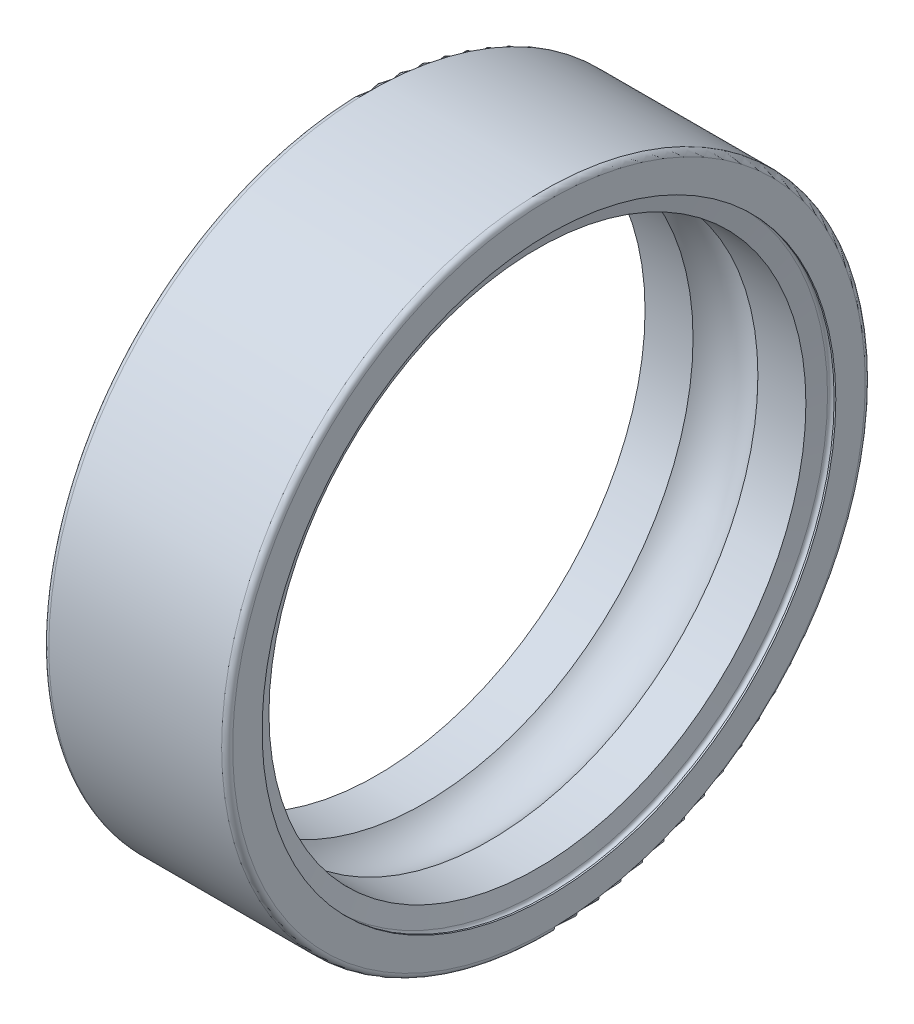
ISO-10303-21;
HEADER;
FILE_DESCRIPTION(('STEP AP214'),'2;1');
FILE_NAME('part.step','',(''),(''),'','','');
FILE_SCHEMA(('AUTOMOTIVE_DESIGN { 1 0 10303 214 1 1 1 1 }'));
ENDSEC;
DATA;
#1=APPLICATION_CONTEXT('core data for automotive mechanical design processes');
#2=APPLICATION_PROTOCOL_DEFINITION('international standard','automotive_design',2000,#1);
#3=PRODUCT_CONTEXT('',#1,'mechanical');
#4=PRODUCT('Part','Part','',(#3));
#5=PRODUCT_RELATED_PRODUCT_CATEGORY('part','',(#4));
#6=PRODUCT_DEFINITION_FORMATION('','',#4);
#7=PRODUCT_DEFINITION_CONTEXT('part definition',#1,'design');
#8=PRODUCT_DEFINITION('design','',#6,#7);
#9=PRODUCT_DEFINITION_SHAPE('','',#8);
#10=(LENGTH_UNIT() NAMED_UNIT(*) SI_UNIT(.MILLI.,.METRE.));
#11=(NAMED_UNIT(*) PLANE_ANGLE_UNIT() SI_UNIT($,.RADIAN.));
#12=(NAMED_UNIT(*) SI_UNIT($,.STERADIAN.) SOLID_ANGLE_UNIT());
#13=UNCERTAINTY_MEASURE_WITH_UNIT(LENGTH_MEASURE(1.E-05),#10,'distance_accuracy_value','');
#14=(GEOMETRIC_REPRESENTATION_CONTEXT(3) GLOBAL_UNCERTAINTY_ASSIGNED_CONTEXT((#13)) GLOBAL_UNIT_ASSIGNED_CONTEXT((#10,
#11,#12)) REPRESENTATION_CONTEXT('',''));
#15=CARTESIAN_POINT('',(0.,0.,0.));
#16=DIRECTION('',(0.,0.,1.));
#17=DIRECTION('',(1.,0.,0.));
#18=AXIS2_PLACEMENT_3D('',#15,#16,#17);
#19=CARTESIAN_POINT('',(50.,0.,0.));
#20=DIRECTION('',(1.,0.,0.));
#21=DIRECTION('',(0.,0.,-1.));
#22=AXIS2_PLACEMENT_3D('',#19,#20,#21);
#23=CYLINDRICAL_SURFACE('',#22,17.5);
#24=CARTESIAN_POINT('',(9.7,0.,0.));
#25=DIRECTION('',(1.,0.,0.));
#26=DIRECTION('',(0.,0.,-1.));
#27=AXIS2_PLACEMENT_3D('',#24,#25,#26);
#28=CIRCLE('',#27,17.5);
#29=CARTESIAN_POINT('',(9.7,0.,-17.5));
#30=VERTEX_POINT('',#29);
#31=EDGE_CURVE('E11',#30,#30,#28,.T.);
#32=ORIENTED_EDGE('',*,*,#31,.F.);
#33=EDGE_LOOP('',(#32));
#34=FACE_BOUND('',#33,.T.);
#35=CARTESIAN_POINT('',(0.3,0.,0.));
#36=DIRECTION('',(1.,0.,0.));
#37=DIRECTION('',(0.,0.,-1.));
#38=AXIS2_PLACEMENT_3D('',#35,#36,#37);
#39=CIRCLE('',#38,17.5);
#40=CARTESIAN_POINT('',(0.3,0.,-17.5));
#41=VERTEX_POINT('',#40);
#42=EDGE_CURVE('E105',#41,#41,#39,.T.);
#43=ORIENTED_EDGE('',*,*,#42,.T.);
#44=EDGE_LOOP('',(#43));
#45=FACE_BOUND('',#44,.T.);
#46=ADVANCED_FACE('F16',(#34,#45),#23,.T.);
#47=CARTESIAN_POINT('',(9.7,0.,0.));
#48=DIRECTION('',(1.,0.,0.));
#49=DIRECTION('',(0.,0.,-1.));
#50=AXIS2_PLACEMENT_3D('',#47,#48,#49);
#51=TOROIDAL_SURFACE('',#50,17.2,0.3);
#52=CARTESIAN_POINT('',(10.,0.,0.));
#53=DIRECTION('',(1.,0.,0.));
#54=DIRECTION('',(0.,0.,-1.));
#55=AXIS2_PLACEMENT_3D('',#52,#53,#54);
#56=CIRCLE('',#55,17.2);
#57=CARTESIAN_POINT('',(10.,0.,-17.2));
#58=VERTEX_POINT('',#57);
#59=EDGE_CURVE('E27',#58,#58,#56,.T.);
#60=ORIENTED_EDGE('',*,*,#59,.F.);
#61=EDGE_LOOP('',(#60));
#62=FACE_BOUND('',#61,.T.);
#63=ORIENTED_EDGE('',*,*,#31,.T.);
#64=EDGE_LOOP('',(#63));
#65=FACE_BOUND('',#64,.T.);
#66=ADVANCED_FACE('F143',(#62,#65),#51,.T.);
#67=CARTESIAN_POINT('',(10.,15.6,0.));
#68=DIRECTION('',(1.,0.,0.));
#69=DIRECTION('',(0.,1.,0.));
#70=AXIS2_PLACEMENT_3D('',#67,#68,#69);
#71=PLANE('',#70);
#72=CARTESIAN_POINT('',(10.,0.,0.));
#73=DIRECTION('',(1.,0.,0.));
#74=DIRECTION('',(0.,0.,-1.));
#75=AXIS2_PLACEMENT_3D('',#72,#73,#74);
#76=CIRCLE('',#75,15.6);
#77=CARTESIAN_POINT('',(10.,0.,-15.6));
#78=VERTEX_POINT('',#77);
#79=EDGE_CURVE('E101',#78,#78,#76,.T.);
#80=ORIENTED_EDGE('',*,*,#79,.F.);
#81=EDGE_LOOP('',(#80));
#82=FACE_BOUND('',#81,.T.);
#83=ORIENTED_EDGE('',*,*,#59,.T.);
#84=EDGE_LOOP('',(#83));
#85=FACE_BOUND('',#84,.T.);
#86=ADVANCED_FACE('F18',(#82,#85),#71,.T.);
#87=CARTESIAN_POINT('',(50.,0.,0.));
#88=DIRECTION('',(1.,0.,0.));
#89=DIRECTION('',(0.,0.,-1.));
#90=AXIS2_PLACEMENT_3D('',#87,#88,#89);
#91=CYLINDRICAL_SURFACE('',#90,15.6);
#92=CARTESIAN_POINT('',(9.91,0.,0.));
#93=DIRECTION('',(1.,0.,0.));
#94=DIRECTION('',(0.,0.,-1.));
#95=AXIS2_PLACEMENT_3D('',#92,#93,#94);
#96=CIRCLE('',#95,15.6);
#97=CARTESIAN_POINT('',(9.91,0.,-15.6));
#98=VERTEX_POINT('',#97);
#99=EDGE_CURVE('E103',#98,#98,#96,.T.);
#100=ORIENTED_EDGE('',*,*,#99,.F.);
#101=EDGE_LOOP('',(#100));
#102=FACE_BOUND('',#101,.T.);
#103=ORIENTED_EDGE('',*,*,#79,.T.);
#104=EDGE_LOOP('',(#103));
#105=FACE_BOUND('',#104,.T.);
#106=ADVANCED_FACE('F135',(#102,#105),#91,.F.);
#107=CARTESIAN_POINT('',(9.73,0.,0.));
#108=DIRECTION('',(1.,0.,0.));
#109=DIRECTION('',(0.,0.,-1.));
#110=AXIS2_PLACEMENT_3D('',#107,#108,#109);
#111=TOROIDAL_SURFACE('',#110,15.6000000094977,0.18);
#112=ORIENTED_EDGE('',*,*,#99,.T.);
#113=EDGE_LOOP('',(#112));
#114=FACE_BOUND('',#113,.T.);
#115=CARTESIAN_POINT('',(9.55,0.,0.));
#116=DIRECTION('',(1.,0.,0.));
#117=DIRECTION('',(0.,0.,-1.));
#118=AXIS2_PLACEMENT_3D('',#115,#116,#117);
#119=CIRCLE('',#118,15.6);
#120=CARTESIAN_POINT('',(9.55,0.,-15.6));
#121=VERTEX_POINT('',#120);
#122=EDGE_CURVE('E113',#121,#121,#119,.T.);
#123=ORIENTED_EDGE('',*,*,#122,.F.);
#124=EDGE_LOOP('',(#123));
#125=FACE_BOUND('',#124,.T.);
#126=ADVANCED_FACE('F132',(#114,#125),#111,.F.);
#127=CARTESIAN_POINT('',(9.37367301929154,0.,0.));
#128=DIRECTION('',(1.,0.,0.));
#129=DIRECTION('',(0.,0.,-1.));
#130=AXIS2_PLACEMENT_3D('',#127,#128,#129);
#131=CONICAL_SURFACE('',#130,14.6,1.39626340159546);
#132=CARTESIAN_POINT('',(9.37367301929154,0.,0.));
#133=DIRECTION('',(1.,0.,0.));
#134=DIRECTION('',(0.,0.,-1.));
#135=AXIS2_PLACEMENT_3D('',#132,#133,#134);
#136=CIRCLE('',#135,14.6);
#137=CARTESIAN_POINT('',(9.37367301929154,0.,-14.6));
#138=VERTEX_POINT('',#137);
#139=EDGE_CURVE('E117',#138,#138,#136,.T.);
#140=ORIENTED_EDGE('',*,*,#139,.F.);
#141=EDGE_LOOP('',(#140));
#142=FACE_BOUND('',#141,.T.);
#143=ORIENTED_EDGE('',*,*,#122,.T.);
#144=EDGE_LOOP('',(#143));
#145=FACE_BOUND('',#144,.T.);
#146=ADVANCED_FACE('F166',(#142,#145),#131,.F.);
#147=CARTESIAN_POINT('',(50.,0.,0.));
#148=DIRECTION('',(1.,0.,0.));
#149=DIRECTION('',(0.,0.,-1.));
#150=AXIS2_PLACEMENT_3D('',#147,#148,#149);
#151=CYLINDRICAL_SURFACE('',#150,14.6);
#152=CARTESIAN_POINT('',(6.76328131618299,0.,0.));
#153=DIRECTION('',(1.,0.,0.));
#154=DIRECTION('',(0.,0.,-1.));
#155=AXIS2_PLACEMENT_3D('',#152,#153,#154);
#156=CIRCLE('',#155,14.6);
#157=CARTESIAN_POINT('',(6.76328131618299,0.,-14.6));
#158=VERTEX_POINT('',#157);
#159=EDGE_CURVE('E119',#158,#158,#156,.T.);
#160=ORIENTED_EDGE('',*,*,#159,.F.);
#161=EDGE_LOOP('',(#160));
#162=FACE_BOUND('',#161,.T.);
#163=ORIENTED_EDGE('',*,*,#139,.T.);
#164=EDGE_LOOP('',(#163));
#165=FACE_BOUND('',#164,.T.);
#166=ADVANCED_FACE('F163',(#162,#165),#151,.F.);
#167=CARTESIAN_POINT('',(5.,0.,0.));
#168=DIRECTION('',(1.,0.,0.));
#169=DIRECTION('',(0.,0.,-1.));
#170=AXIS2_PLACEMENT_3D('',#167,#168,#169);
#171=TOROIDAL_SURFACE('',#170,13.,2.381);
#172=ORIENTED_EDGE('',*,*,#159,.T.);
#173=EDGE_LOOP('',(#172));
#174=FACE_BOUND('',#173,.T.);
#175=CARTESIAN_POINT('',(3.23671868381702,0.,0.));
#176=DIRECTION('',(1.,0.,0.));
#177=DIRECTION('',(0.,0.,-1.));
#178=AXIS2_PLACEMENT_3D('',#175,#176,#177);
#179=CIRCLE('',#178,14.6);
#180=CARTESIAN_POINT('',(3.23671868381702,0.,-14.6));
#181=VERTEX_POINT('',#180);
#182=EDGE_CURVE('E20',#181,#181,#179,.T.);
#183=ORIENTED_EDGE('',*,*,#182,.F.);
#184=EDGE_LOOP('',(#183));
#185=FACE_BOUND('',#184,.T.);
#186=ADVANCED_FACE('F155',(#174,#185),#171,.F.);
#187=CARTESIAN_POINT('',(50.,0.,0.));
#188=DIRECTION('',(1.,0.,0.));
#189=DIRECTION('',(0.,0.,-1.));
#190=AXIS2_PLACEMENT_3D('',#187,#188,#189);
#191=CYLINDRICAL_SURFACE('',#190,14.6);
#192=CARTESIAN_POINT('',(0.626326980708462,0.,0.));
#193=DIRECTION('',(1.,0.,0.));
#194=DIRECTION('',(0.,0.,-1.));
#195=AXIS2_PLACEMENT_3D('',#192,#193,#194);
#196=CIRCLE('',#195,14.6);
#197=CARTESIAN_POINT('',(0.626326980708462,0.,-14.6));
#198=VERTEX_POINT('',#197);
#199=EDGE_CURVE('E80',#198,#198,#196,.T.);
#200=ORIENTED_EDGE('',*,*,#199,.F.);
#201=EDGE_LOOP('',(#200));
#202=FACE_BOUND('',#201,.T.);
#203=ORIENTED_EDGE('',*,*,#182,.T.);
#204=EDGE_LOOP('',(#203));
#205=FACE_BOUND('',#204,.T.);
#206=ADVANCED_FACE('F168',(#202,#205),#191,.F.);
#207=CARTESIAN_POINT('',(0.45,0.,0.));
#208=DIRECTION('',(-1.,0.,0.));
#209=DIRECTION('',(0.,0.,1.));
#210=AXIS2_PLACEMENT_3D('',#207,#208,#209);
#211=CONICAL_SURFACE('',#210,15.6,1.39626340159546);
#212=CARTESIAN_POINT('',(0.45,0.,0.));
#213=DIRECTION('',(1.,0.,0.));
#214=DIRECTION('',(0.,0.,-1.));
#215=AXIS2_PLACEMENT_3D('',#212,#213,#214);
#216=CIRCLE('',#215,15.6);
#217=CARTESIAN_POINT('',(0.45,0.,-15.6));
#218=VERTEX_POINT('',#217);
#219=EDGE_CURVE('E86',#218,#218,#216,.T.);
#220=ORIENTED_EDGE('',*,*,#219,.F.);
#221=EDGE_LOOP('',(#220));
#222=FACE_BOUND('',#221,.T.);
#223=ORIENTED_EDGE('',*,*,#199,.T.);
#224=EDGE_LOOP('',(#223));
#225=FACE_BOUND('',#224,.T.);
#226=ADVANCED_FACE('F171',(#222,#225),#211,.F.);
#227=CARTESIAN_POINT('',(0.27,0.,0.));
#228=DIRECTION('',(1.,0.,0.));
#229=DIRECTION('',(0.,0.,-1.));
#230=AXIS2_PLACEMENT_3D('',#227,#228,#229);
#231=TOROIDAL_SURFACE('',#230,15.6,0.18);
#232=ORIENTED_EDGE('',*,*,#219,.T.);
#233=EDGE_LOOP('',(#232));
#234=FACE_BOUND('',#233,.T.);
#235=CARTESIAN_POINT('',(0.09,0.,0.));
#236=DIRECTION('',(1.,0.,0.));
#237=DIRECTION('',(0.,0.,-1.));
#238=AXIS2_PLACEMENT_3D('',#235,#236,#237);
#239=CIRCLE('',#238,15.6);
#240=CARTESIAN_POINT('',(0.09,0.,-15.6));
#241=VERTEX_POINT('',#240);
#242=EDGE_CURVE('E91',#241,#241,#239,.T.);
#243=ORIENTED_EDGE('',*,*,#242,.F.);
#244=EDGE_LOOP('',(#243));
#245=FACE_BOUND('',#244,.T.);
#246=ADVANCED_FACE('F87',(#234,#245),#231,.F.);
#247=CARTESIAN_POINT('',(50.,0.,0.));
#248=DIRECTION('',(1.,0.,0.));
#249=DIRECTION('',(0.,0.,-1.));
#250=AXIS2_PLACEMENT_3D('',#247,#248,#249);
#251=CYLINDRICAL_SURFACE('',#250,15.6);
#252=CARTESIAN_POINT('',(0.,0.,0.));
#253=DIRECTION('',(1.,0.,0.));
#254=DIRECTION('',(0.,0.,-1.));
#255=AXIS2_PLACEMENT_3D('',#252,#253,#254);
#256=CIRCLE('',#255,15.6);
#257=CARTESIAN_POINT('',(0.,0.,-15.6));
#258=VERTEX_POINT('',#257);
#259=EDGE_CURVE('E98',#258,#258,#256,.T.);
#260=ORIENTED_EDGE('',*,*,#259,.F.);
#261=EDGE_LOOP('',(#260));
#262=FACE_BOUND('',#261,.T.);
#263=ORIENTED_EDGE('',*,*,#242,.T.);
#264=EDGE_LOOP('',(#263));
#265=FACE_BOUND('',#264,.T.);
#266=ADVANCED_FACE('F161',(#262,#265),#251,.F.);
#267=CARTESIAN_POINT('',(0.,17.2,0.));
#268=DIRECTION('',(-1.,0.,0.));
#269=DIRECTION('',(0.,0.,1.));
#270=AXIS2_PLACEMENT_3D('',#267,#268,#269);
#271=PLANE('',#270);
#272=CARTESIAN_POINT('',(0.,0.,0.));
#273=DIRECTION('',(1.,0.,0.));
#274=DIRECTION('',(0.,0.,-1.));
#275=AXIS2_PLACEMENT_3D('',#272,#273,#274);
#276=CIRCLE('',#275,17.2);
#277=CARTESIAN_POINT('',(0.,0.,-17.2));
#278=VERTEX_POINT('',#277);
#279=EDGE_CURVE('E108',#278,#278,#276,.T.);
#280=ORIENTED_EDGE('',*,*,#279,.F.);
#281=EDGE_LOOP('',(#280));
#282=FACE_BOUND('',#281,.T.);
#283=ORIENTED_EDGE('',*,*,#259,.T.);
#284=EDGE_LOOP('',(#283));
#285=FACE_BOUND('',#284,.T.);
#286=ADVANCED_FACE('F157',(#282,#285),#271,.T.);
#287=CARTESIAN_POINT('',(0.3,0.,0.));
#288=DIRECTION('',(1.,0.,0.));
#289=DIRECTION('',(0.,0.,-1.));
#290=AXIS2_PLACEMENT_3D('',#287,#288,#289);
#291=TOROIDAL_SURFACE('',#290,17.2,0.3);
#292=ORIENTED_EDGE('',*,*,#42,.F.);
#293=EDGE_LOOP('',(#292));
#294=FACE_BOUND('',#293,.T.);
#295=ORIENTED_EDGE('',*,*,#279,.T.);
#296=EDGE_LOOP('',(#295));
#297=FACE_BOUND('',#296,.T.);
#298=ADVANCED_FACE('F160',(#294,#297),#291,.T.);
#299=CLOSED_SHELL('',(#46,#66,#86,#106,#126,#146,#166,#186,#206,#226,#246,#266,#286,#298));
#300=MANIFOLD_SOLID_BREP('B1',#299);
#301=ADVANCED_BREP_SHAPE_REPRESENTATION('',(#18,#300),#14);
#302=SHAPE_DEFINITION_REPRESENTATION(#9,#301);
ENDSEC;
END-ISO-10303-21;
